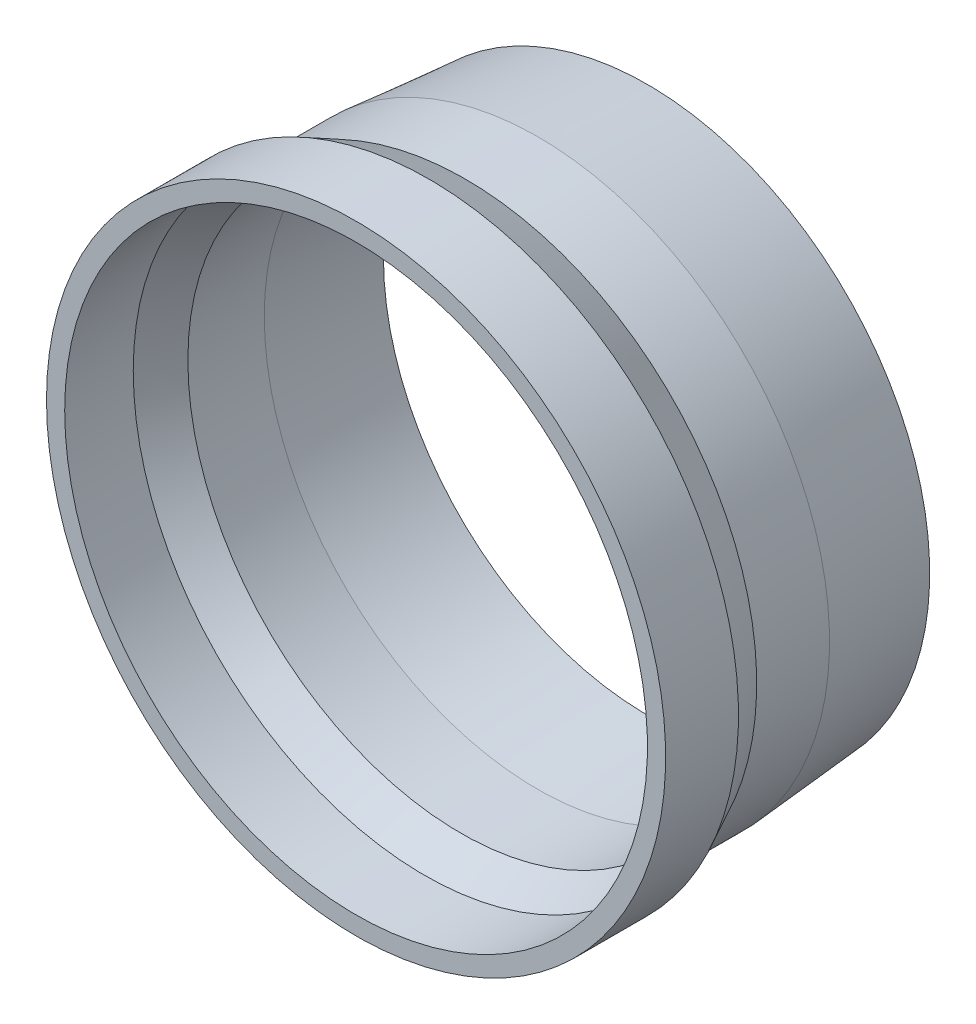
ISO-10303-21;
HEADER;
FILE_DESCRIPTION(('STEP AP214'),'2;1');
FILE_NAME('part.step','',(''),(''),'','','');
FILE_SCHEMA(('AUTOMOTIVE_DESIGN { 1 0 10303 214 1 1 1 1 }'));
ENDSEC;
DATA;
#1=APPLICATION_CONTEXT('core data for automotive mechanical design processes');
#2=APPLICATION_PROTOCOL_DEFINITION('international standard','automotive_design',2000,#1);
#3=PRODUCT_CONTEXT('',#1,'mechanical');
#4=PRODUCT('Part','Part','',(#3));
#5=PRODUCT_RELATED_PRODUCT_CATEGORY('part','',(#4));
#6=PRODUCT_DEFINITION_FORMATION('','',#4);
#7=PRODUCT_DEFINITION_CONTEXT('part definition',#1,'design');
#8=PRODUCT_DEFINITION('design','',#6,#7);
#9=PRODUCT_DEFINITION_SHAPE('','',#8);
#10=(LENGTH_UNIT() NAMED_UNIT(*) SI_UNIT(.MILLI.,.METRE.));
#11=(NAMED_UNIT(*) PLANE_ANGLE_UNIT() SI_UNIT($,.RADIAN.));
#12=(NAMED_UNIT(*) SI_UNIT($,.STERADIAN.) SOLID_ANGLE_UNIT());
#13=UNCERTAINTY_MEASURE_WITH_UNIT(LENGTH_MEASURE(1.E-05),#10,'distance_accuracy_value','');
#14=(GEOMETRIC_REPRESENTATION_CONTEXT(3) GLOBAL_UNCERTAINTY_ASSIGNED_CONTEXT((#13)) GLOBAL_UNIT_ASSIGNED_CONTEXT((#10,
#11,#12)) REPRESENTATION_CONTEXT('',''));
#15=CARTESIAN_POINT('',(0.,0.,0.));
#16=DIRECTION('',(0.,0.,1.));
#17=DIRECTION('',(1.,0.,0.));
#18=AXIS2_PLACEMENT_3D('',#15,#16,#17);
#19=CARTESIAN_POINT('',(0.,0.,0.));
#20=DIRECTION('',(0.,0.,-1.));
#21=DIRECTION('',(-1.,0.,0.));
#22=AXIS2_PLACEMENT_3D('',#19,#20,#21);
#23=CYLINDRICAL_SURFACE('',#22,50.8);
#24=CARTESIAN_POINT('',(0.,0.,38.8495158285619));
#25=DIRECTION('',(0.,0.,-1.));
#26=DIRECTION('',(-1.,0.,0.));
#27=AXIS2_PLACEMENT_3D('',#24,#25,#26);
#28=CIRCLE('',#27,50.8);
#29=CARTESIAN_POINT('',(-50.8,0.,38.8495158285619));
#30=VERTEX_POINT('',#29);
#31=EDGE_CURVE('E66',#30,#30,#28,.T.);
#32=ORIENTED_EDGE('',*,*,#31,.T.);
#33=EDGE_LOOP('',(#32));
#34=FACE_BOUND('',#33,.T.);
#35=CARTESIAN_POINT('',(0.,0.,50.8));
#36=DIRECTION('',(0.,0.,-1.));
#37=DIRECTION('',(-1.,0.,0.));
#38=AXIS2_PLACEMENT_3D('',#35,#36,#37);
#39=CIRCLE('',#38,50.8);
#40=CARTESIAN_POINT('',(-50.8,0.,50.8));
#41=VERTEX_POINT('',#40);
#42=EDGE_CURVE('E10',#41,#41,#39,.T.);
#43=ORIENTED_EDGE('',*,*,#42,.F.);
#44=EDGE_LOOP('',(#43));
#45=FACE_BOUND('',#44,.T.);
#46=ADVANCED_FACE('F32',(#34,#45),#23,.F.);
#47=CARTESIAN_POINT('',(0.,53.975,50.8));
#48=DIRECTION('',(0.,0.,1.));
#49=DIRECTION('',(1.,0.,0.));
#50=AXIS2_PLACEMENT_3D('',#47,#48,#49);
#51=PLANE('',#50);
#52=ORIENTED_EDGE('',*,*,#42,.T.);
#53=EDGE_LOOP('',(#52));
#54=FACE_BOUND('',#53,.T.);
#55=CARTESIAN_POINT('',(0.,0.,50.8));
#56=DIRECTION('',(0.,0.,-1.));
#57=DIRECTION('',(-1.,0.,0.));
#58=AXIS2_PLACEMENT_3D('',#55,#56,#57);
#59=CIRCLE('',#58,53.975);
#60=CARTESIAN_POINT('',(-53.975,0.,50.8));
#61=VERTEX_POINT('',#60);
#62=EDGE_CURVE('E38',#61,#61,#59,.T.);
#63=ORIENTED_EDGE('',*,*,#62,.F.);
#64=EDGE_LOOP('',(#63));
#65=FACE_BOUND('',#64,.T.);
#66=ADVANCED_FACE('F84',(#54,#65),#51,.T.);
#67=CARTESIAN_POINT('',(0.,0.,0.));
#68=DIRECTION('',(0.,0.,-1.));
#69=DIRECTION('',(-1.,0.,0.));
#70=AXIS2_PLACEMENT_3D('',#67,#68,#69);
#71=CYLINDRICAL_SURFACE('',#70,53.975);
#72=ORIENTED_EDGE('',*,*,#62,.T.);
#73=EDGE_LOOP('',(#72));
#74=FACE_BOUND('',#73,.T.);
#75=CARTESIAN_POINT('',(0.,0.,38.1));
#76=DIRECTION('',(0.,0.,-1.));
#77=DIRECTION('',(-1.,0.,0.));
#78=AXIS2_PLACEMENT_3D('',#75,#76,#77);
#79=CIRCLE('',#78,53.975);
#80=CARTESIAN_POINT('',(-53.975,0.,38.1));
#81=VERTEX_POINT('',#80);
#82=EDGE_CURVE('E42',#81,#81,#79,.T.);
#83=ORIENTED_EDGE('',*,*,#82,.F.);
#84=EDGE_LOOP('',(#83));
#85=FACE_BOUND('',#84,.T.);
#86=ADVANCED_FACE('F88',(#74,#85),#71,.T.);
#87=CARTESIAN_POINT('',(0.,0.,31.75));
#88=DIRECTION('',(0.,0.,1.));
#89=DIRECTION('',(1.,0.,0.));
#90=AXIS2_PLACEMENT_3D('',#87,#88,#89);
#91=CONICAL_SURFACE('',#90,50.8,0.463647609000805);
#92=ORIENTED_EDGE('',*,*,#82,.T.);
#93=EDGE_LOOP('',(#92));
#94=FACE_BOUND('',#93,.T.);
#95=CARTESIAN_POINT('',(0.,0.,31.75));
#96=DIRECTION('',(0.,0.,-1.));
#97=DIRECTION('',(-1.,0.,0.));
#98=AXIS2_PLACEMENT_3D('',#95,#96,#97);
#99=CIRCLE('',#98,50.8);
#100=CARTESIAN_POINT('',(-50.8,0.,31.75));
#101=VERTEX_POINT('',#100);
#102=EDGE_CURVE('E46',#101,#101,#99,.T.);
#103=ORIENTED_EDGE('',*,*,#102,.F.);
#104=EDGE_LOOP('',(#103));
#105=FACE_BOUND('',#104,.T.);
#106=ADVANCED_FACE('F92',(#94,#105),#91,.T.);
#107=CARTESIAN_POINT('',(0.,0.,0.));
#108=DIRECTION('',(0.,0.,-1.));
#109=DIRECTION('',(-1.,0.,0.));
#110=AXIS2_PLACEMENT_3D('',#107,#108,#109);
#111=CYLINDRICAL_SURFACE('',#110,50.8);
#112=ORIENTED_EDGE('',*,*,#102,.T.);
#113=EDGE_LOOP('',(#112));
#114=FACE_BOUND('',#113,.T.);
#115=CARTESIAN_POINT('',(0.,0.,19.05));
#116=DIRECTION('',(0.,0.,-1.));
#117=DIRECTION('',(-1.,0.,0.));
#118=AXIS2_PLACEMENT_3D('',#115,#116,#117);
#119=CIRCLE('',#118,50.8);
#120=CARTESIAN_POINT('',(-50.8,0.,19.05));
#121=VERTEX_POINT('',#120);
#122=EDGE_CURVE('E51',#121,#121,#119,.T.);
#123=ORIENTED_EDGE('',*,*,#122,.F.);
#124=EDGE_LOOP('',(#123));
#125=FACE_BOUND('',#124,.T.);
#126=ADVANCED_FACE('F98',(#114,#125),#111,.T.);
#127=CARTESIAN_POINT('',(0.,0.,0.));
#128=DIRECTION('',(0.,0.,1.));
#129=DIRECTION('',(1.,0.,0.));
#130=AXIS2_PLACEMENT_3D('',#127,#128,#129);
#131=CONICAL_SURFACE('',#130,49.2125,0.0831412318884411);
#132=ORIENTED_EDGE('',*,*,#122,.T.);
#133=EDGE_LOOP('',(#132));
#134=FACE_BOUND('',#133,.T.);
#135=CARTESIAN_POINT('',(0.,0.,0.));
#136=DIRECTION('',(0.,0.,-1.));
#137=DIRECTION('',(-1.,0.,0.));
#138=AXIS2_PLACEMENT_3D('',#135,#136,#137);
#139=CIRCLE('',#138,49.2125);
#140=CARTESIAN_POINT('',(-49.2125,0.,0.));
#141=VERTEX_POINT('',#140);
#142=EDGE_CURVE('E54',#141,#141,#139,.T.);
#143=ORIENTED_EDGE('',*,*,#142,.F.);
#144=EDGE_LOOP('',(#143));
#145=FACE_BOUND('',#144,.T.);
#146=ADVANCED_FACE('F102',(#134,#145),#131,.T.);
#147=CARTESIAN_POINT('',(0.,49.2125,0.));
#148=DIRECTION('',(0.,0.,-1.));
#149=DIRECTION('',(-1.,0.,0.));
#150=AXIS2_PLACEMENT_3D('',#147,#148,#149);
#151=PLANE('',#150);
#152=ORIENTED_EDGE('',*,*,#142,.T.);
#153=EDGE_LOOP('',(#152));
#154=FACE_BOUND('',#153,.T.);
#155=CARTESIAN_POINT('',(0.,0.,0.));
#156=DIRECTION('',(0.,0.,-1.));
#157=DIRECTION('',(-1.,0.,0.));
#158=AXIS2_PLACEMENT_3D('',#155,#156,#157);
#159=CIRCLE('',#158,46.0264947676945);
#160=CARTESIAN_POINT('',(-46.0264947676945,0.,0.));
#161=VERTEX_POINT('',#160);
#162=EDGE_CURVE('E57',#161,#161,#159,.T.);
#163=ORIENTED_EDGE('',*,*,#162,.F.);
#164=EDGE_LOOP('',(#163));
#165=FACE_BOUND('',#164,.T.);
#166=ADVANCED_FACE('F106',(#154,#165),#151,.T.);
#167=CARTESIAN_POINT('',(0.,0.,19.1820627876656));
#168=DIRECTION('',(0.,0.,1.));
#169=DIRECTION('',(1.,0.,0.));
#170=AXIS2_PLACEMENT_3D('',#167,#168,#169);
#171=CONICAL_SURFACE('',#170,47.625,0.0831412318884409);
#172=ORIENTED_EDGE('',*,*,#162,.T.);
#173=EDGE_LOOP('',(#172));
#174=FACE_BOUND('',#173,.T.);
#175=CARTESIAN_POINT('',(0.,0.,19.1820627876656));
#176=DIRECTION('',(0.,0.,-1.));
#177=DIRECTION('',(-1.,0.,0.));
#178=AXIS2_PLACEMENT_3D('',#175,#176,#177);
#179=CIRCLE('',#178,47.625);
#180=CARTESIAN_POINT('',(-47.625,0.,19.1820627876656));
#181=VERTEX_POINT('',#180);
#182=EDGE_CURVE('E60',#181,#181,#179,.T.);
#183=ORIENTED_EDGE('',*,*,#182,.F.);
#184=EDGE_LOOP('',(#183));
#185=FACE_BOUND('',#184,.T.);
#186=ADVANCED_FACE('F80',(#174,#185),#171,.F.);
#187=CARTESIAN_POINT('',(0.,0.,0.));
#188=DIRECTION('',(0.,0.,-1.));
#189=DIRECTION('',(-1.,0.,0.));
#190=AXIS2_PLACEMENT_3D('',#187,#188,#189);
#191=CYLINDRICAL_SURFACE('',#190,47.625);
#192=ORIENTED_EDGE('',*,*,#182,.T.);
#193=EDGE_LOOP('',(#192));
#194=FACE_BOUND('',#193,.T.);
#195=CARTESIAN_POINT('',(0.,0.,32.4995158285619));
#196=DIRECTION('',(0.,0.,-1.));
#197=DIRECTION('',(-1.,0.,0.));
#198=AXIS2_PLACEMENT_3D('',#195,#196,#197);
#199=CIRCLE('',#198,47.625);
#200=CARTESIAN_POINT('',(-47.625,0.,32.4995158285619));
#201=VERTEX_POINT('',#200);
#202=EDGE_CURVE('E63',#201,#201,#199,.T.);
#203=ORIENTED_EDGE('',*,*,#202,.F.);
#204=EDGE_LOOP('',(#203));
#205=FACE_BOUND('',#204,.T.);
#206=ADVANCED_FACE('F74',(#194,#205),#191,.F.);
#207=CARTESIAN_POINT('',(0.,0.,38.8495158285619));
#208=DIRECTION('',(0.,0.,1.));
#209=DIRECTION('',(1.,0.,0.));
#210=AXIS2_PLACEMENT_3D('',#207,#208,#209);
#211=CONICAL_SURFACE('',#210,50.8,0.463647609000804);
#212=ORIENTED_EDGE('',*,*,#202,.T.);
#213=EDGE_LOOP('',(#212));
#214=FACE_BOUND('',#213,.T.);
#215=ORIENTED_EDGE('',*,*,#31,.F.);
#216=EDGE_LOOP('',(#215));
#217=FACE_BOUND('',#216,.T.);
#218=ADVANCED_FACE('F72',(#214,#217),#211,.F.);
#219=CLOSED_SHELL('',(#46,#66,#86,#106,#126,#146,#166,#186,#206,#218));
#220=MANIFOLD_SOLID_BREP('B2',#219);
#221=ADVANCED_BREP_SHAPE_REPRESENTATION('',(#18,#220),#14);
#222=SHAPE_DEFINITION_REPRESENTATION(#9,#221);
ENDSEC;
END-ISO-10303-21;
